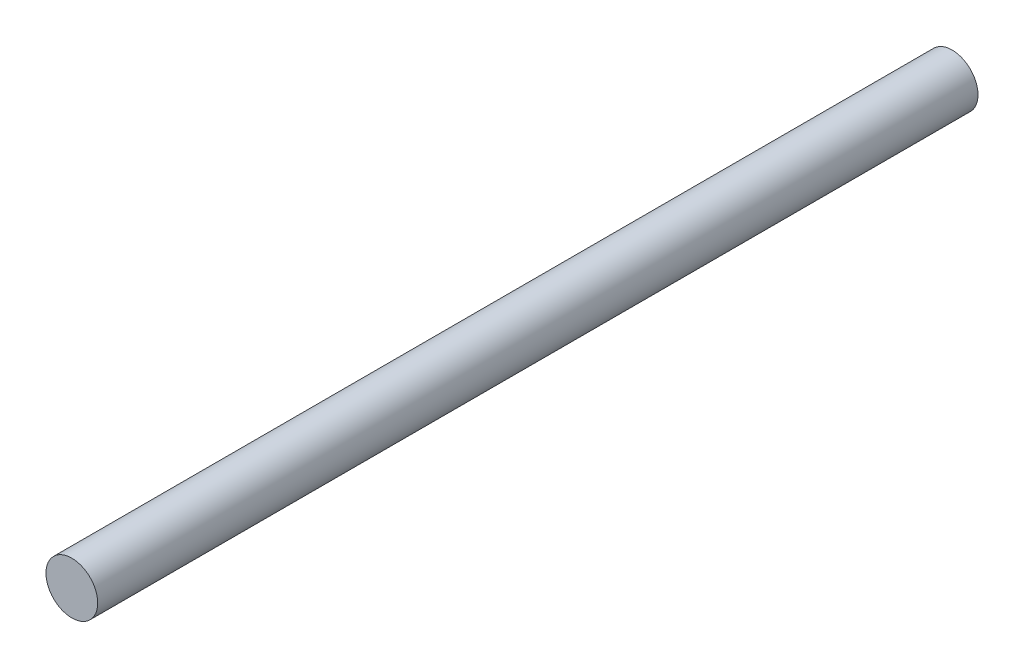
ISO-10303-21;
HEADER;
FILE_DESCRIPTION(('STEP AP214'),'2;1');
FILE_NAME('part.step','',(''),(''),'','','');
FILE_SCHEMA(('AUTOMOTIVE_DESIGN { 1 0 10303 214 1 1 1 1 }'));
ENDSEC;
DATA;
#1=APPLICATION_CONTEXT('core data for automotive mechanical design processes');
#2=APPLICATION_PROTOCOL_DEFINITION('international standard','automotive_design',2000,#1);
#3=PRODUCT_CONTEXT('',#1,'mechanical');
#4=PRODUCT('Part','Part','',(#3));
#5=PRODUCT_RELATED_PRODUCT_CATEGORY('part','',(#4));
#6=PRODUCT_DEFINITION_FORMATION('','',#4);
#7=PRODUCT_DEFINITION_CONTEXT('part definition',#1,'design');
#8=PRODUCT_DEFINITION('design','',#6,#7);
#9=PRODUCT_DEFINITION_SHAPE('','',#8);
#10=(LENGTH_UNIT() NAMED_UNIT(*) SI_UNIT(.MILLI.,.METRE.));
#11=(NAMED_UNIT(*) PLANE_ANGLE_UNIT() SI_UNIT($,.RADIAN.));
#12=(NAMED_UNIT(*) SI_UNIT($,.STERADIAN.) SOLID_ANGLE_UNIT());
#13=UNCERTAINTY_MEASURE_WITH_UNIT(LENGTH_MEASURE(1.E-05),#10,'distance_accuracy_value','');
#14=(GEOMETRIC_REPRESENTATION_CONTEXT(3) GLOBAL_UNCERTAINTY_ASSIGNED_CONTEXT((#13)) GLOBAL_UNIT_ASSIGNED_CONTEXT((#10,
#11,#12)) REPRESENTATION_CONTEXT('',''));
#15=CARTESIAN_POINT('',(0.,0.,0.));
#16=DIRECTION('',(0.,0.,1.));
#17=DIRECTION('',(1.,0.,0.));
#18=AXIS2_PLACEMENT_3D('',#15,#16,#17);
#19=CARTESIAN_POINT('',(0.,0.,170.));
#20=DIRECTION('',(0.,0.,-1.));
#21=DIRECTION('',(-1.,0.,0.));
#22=AXIS2_PLACEMENT_3D('',#19,#20,#21);
#23=CYLINDRICAL_SURFACE('',#22,5.);
#24=CARTESIAN_POINT('',(0.,0.,170.));
#25=DIRECTION('',(0.,0.,1.));
#26=DIRECTION('',(1.,0.,0.));
#27=AXIS2_PLACEMENT_3D('',#24,#25,#26);
#28=CIRCLE('',#27,5.);
#29=CARTESIAN_POINT('',(5.,0.,170.));
#30=VERTEX_POINT('',#29);
#31=EDGE_CURVE('E10',#30,#30,#28,.T.);
#32=ORIENTED_EDGE('',*,*,#31,.F.);
#33=EDGE_LOOP('',(#32));
#34=FACE_BOUND('',#33,.T.);
#35=CARTESIAN_POINT('',(0.,0.,0.));
#36=DIRECTION('',(0.,0.,1.));
#37=DIRECTION('',(1.,0.,0.));
#38=AXIS2_PLACEMENT_3D('',#35,#36,#37);
#39=CIRCLE('',#38,5.);
#40=CARTESIAN_POINT('',(5.,0.,0.));
#41=VERTEX_POINT('',#40);
#42=EDGE_CURVE('E42',#41,#41,#39,.T.);
#43=ORIENTED_EDGE('',*,*,#42,.T.);
#44=EDGE_LOOP('',(#43));
#45=FACE_BOUND('',#44,.T.);
#46=ADVANCED_FACE('F39',(#34,#45),#23,.T.);
#47=CARTESIAN_POINT('',(0.,0.,170.));
#48=DIRECTION('',(0.,0.,1.));
#49=DIRECTION('',(1.,0.,0.));
#50=AXIS2_PLACEMENT_3D('',#47,#48,#49);
#51=PLANE('',#50);
#52=ORIENTED_EDGE('',*,*,#31,.T.);
#53=EDGE_LOOP('',(#52));
#54=FACE_BOUND('',#53,.T.);
#55=ADVANCED_FACE('F56',(#54),#51,.T.);
#56=CARTESIAN_POINT('',(0.,0.,0.));
#57=DIRECTION('',(0.,0.,1.));
#58=DIRECTION('',(1.,0.,0.));
#59=AXIS2_PLACEMENT_3D('',#56,#57,#58);
#60=PLANE('',#59);
#61=ORIENTED_EDGE('',*,*,#42,.F.);
#62=EDGE_LOOP('',(#61));
#63=FACE_BOUND('',#62,.T.);
#64=ADVANCED_FACE('F54',(#63),#60,.F.);
#65=CLOSED_SHELL('',(#46,#55,#64));
#66=MANIFOLD_SOLID_BREP('B2',#65);
#67=ADVANCED_BREP_SHAPE_REPRESENTATION('',(#18,#66),#14);
#68=SHAPE_DEFINITION_REPRESENTATION(#9,#67);
ENDSEC;
END-ISO-10303-21;
